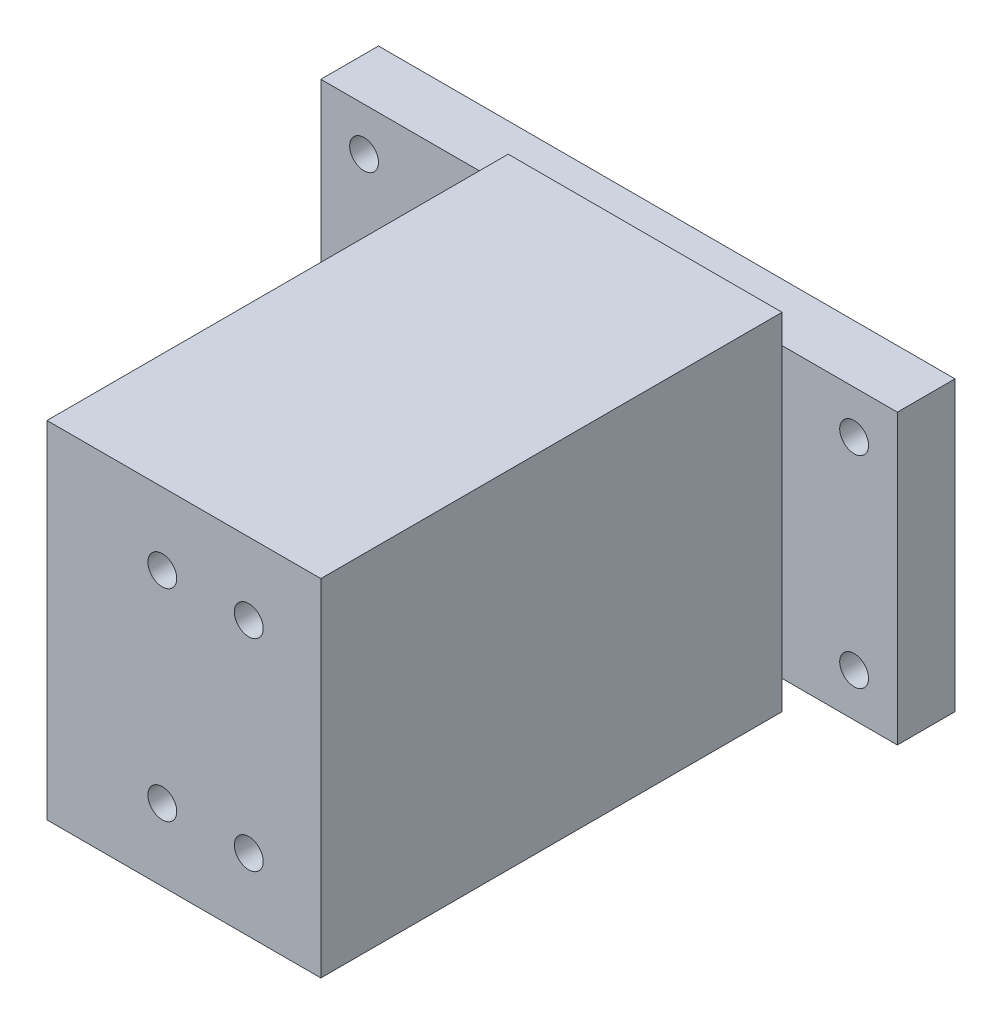
ISO-10303-21;
HEADER;
FILE_DESCRIPTION(('STEP AP214'),'2;1');
FILE_NAME('part.step','',(''),(''),'','','');
FILE_SCHEMA(('AUTOMOTIVE_DESIGN { 1 0 10303 214 1 1 1 1 }'));
ENDSEC;
DATA;
#1=APPLICATION_CONTEXT('core data for automotive mechanical design processes');
#2=APPLICATION_PROTOCOL_DEFINITION('international standard','automotive_design',2000,#1);
#3=PRODUCT_CONTEXT('',#1,'mechanical');
#4=PRODUCT('Part','Part','',(#3));
#5=PRODUCT_RELATED_PRODUCT_CATEGORY('part','',(#4));
#6=PRODUCT_DEFINITION_FORMATION('','',#4);
#7=PRODUCT_DEFINITION_CONTEXT('part definition',#1,'design');
#8=PRODUCT_DEFINITION('design','',#6,#7);
#9=PRODUCT_DEFINITION_SHAPE('','',#8);
#10=(LENGTH_UNIT() NAMED_UNIT(*) SI_UNIT(.MILLI.,.METRE.));
#11=(NAMED_UNIT(*) PLANE_ANGLE_UNIT() SI_UNIT($,.RADIAN.));
#12=(NAMED_UNIT(*) SI_UNIT($,.STERADIAN.) SOLID_ANGLE_UNIT());
#13=UNCERTAINTY_MEASURE_WITH_UNIT(LENGTH_MEASURE(1.E-05),#10,'distance_accuracy_value','');
#14=(GEOMETRIC_REPRESENTATION_CONTEXT(3) GLOBAL_UNCERTAINTY_ASSIGNED_CONTEXT((#13)) GLOBAL_UNIT_ASSIGNED_CONTEXT((#10,
#11,#12)) REPRESENTATION_CONTEXT('',''));
#15=CARTESIAN_POINT('',(0.,0.,0.));
#16=DIRECTION('',(0.,0.,1.));
#17=DIRECTION('',(1.,0.,0.));
#18=AXIS2_PLACEMENT_3D('',#15,#16,#17);
#19=CARTESIAN_POINT('',(0.,0.,10.));
#20=DIRECTION('',(0.,0.,1.));
#21=DIRECTION('',(1.,0.,0.));
#22=AXIS2_PLACEMENT_3D('',#19,#20,#21);
#23=PLANE('',#22);
#24=DIRECTION('',(0.,1.,0.));
#25=VECTOR('',#24,1.);
#26=CARTESIAN_POINT('',(30.,30.,10.));
#27=LINE('',#26,#25);
#28=CARTESIAN_POINT('',(30.,-25.,10.));
#29=VERTEX_POINT('',#28);
#30=CARTESIAN_POINT('',(30.,25.,10.));
#31=VERTEX_POINT('',#30);
#32=EDGE_CURVE('E11',#29,#31,#27,.T.);
#33=ORIENTED_EDGE('',*,*,#32,.F.);
#34=DIRECTION('',(1.,0.,0.));
#35=VECTOR('',#34,1.);
#36=CARTESIAN_POINT('',(-50.,-25.,10.));
#37=LINE('',#36,#35);
#38=CARTESIAN_POINT('',(50.,-25.,10.));
#39=VERTEX_POINT('',#38);
#40=EDGE_CURVE('E202',#29,#39,#37,.T.);
#41=ORIENTED_EDGE('',*,*,#40,.T.);
#42=DIRECTION('',(0.,1.,0.));
#43=VECTOR('',#42,1.);
#44=CARTESIAN_POINT('',(50.,25.,10.));
#45=LINE('',#44,#43);
#46=CARTESIAN_POINT('',(50.,25.,10.));
#47=VERTEX_POINT('',#46);
#48=EDGE_CURVE('E189',#39,#47,#45,.T.);
#49=ORIENTED_EDGE('',*,*,#48,.T.);
#50=DIRECTION('',(-1.,0.,0.));
#51=VECTOR('',#50,1.);
#52=CARTESIAN_POINT('',(-50.,25.,10.));
#53=LINE('',#52,#51);
#54=EDGE_CURVE('E195',#47,#31,#53,.T.);
#55=ORIENTED_EDGE('',*,*,#54,.T.);
#56=EDGE_LOOP('',(#33,#41,#49,#55));
#57=FACE_BOUND('',#56,.T.);
#58=CARTESIAN_POINT('',(42.5,17.5,10.));
#59=DIRECTION('',(0.,0.,1.));
#60=DIRECTION('',(1.,0.,0.));
#61=AXIS2_PLACEMENT_3D('',#58,#59,#60);
#62=CIRCLE('',#61,2.5);
#63=CARTESIAN_POINT('',(45.,17.5,10.));
#64=VERTEX_POINT('',#63);
#65=EDGE_CURVE('E173',#64,#64,#62,.T.);
#66=ORIENTED_EDGE('',*,*,#65,.F.);
#67=EDGE_LOOP('',(#66));
#68=FACE_BOUND('',#67,.T.);
#69=CARTESIAN_POINT('',(42.5,-17.5,10.));
#70=DIRECTION('',(0.,0.,1.));
#71=DIRECTION('',(1.,0.,0.));
#72=AXIS2_PLACEMENT_3D('',#69,#70,#71);
#73=CIRCLE('',#72,2.5);
#74=CARTESIAN_POINT('',(45.,-17.5,10.));
#75=VERTEX_POINT('',#74);
#76=EDGE_CURVE('E165',#75,#75,#73,.T.);
#77=ORIENTED_EDGE('',*,*,#76,.F.);
#78=EDGE_LOOP('',(#77));
#79=FACE_BOUND('',#78,.T.);
#80=ADVANCED_FACE('F42',(#57,#68,#79),#23,.T.);
#81=DIRECTION('',(0.,-1.,0.));
#82=VECTOR('',#81,1.);
#83=CARTESIAN_POINT('',(-17.5,30.,10.));
#84=LINE('',#83,#82);
#85=CARTESIAN_POINT('',(-17.5,25.,10.));
#86=VERTEX_POINT('',#85);
#87=CARTESIAN_POINT('',(-17.5,-25.,10.));
#88=VERTEX_POINT('',#87);
#89=EDGE_CURVE('E52',#86,#88,#84,.T.);
#90=ORIENTED_EDGE('',*,*,#89,.F.);
#91=CARTESIAN_POINT('',(-50.,25.,10.));
#92=VERTEX_POINT('',#91);
#93=EDGE_CURVE('E193',#86,#92,#53,.T.);
#94=ORIENTED_EDGE('',*,*,#93,.T.);
#95=DIRECTION('',(0.,-1.,0.));
#96=VECTOR('',#95,1.);
#97=CARTESIAN_POINT('',(-50.,25.,10.));
#98=LINE('',#97,#96);
#99=CARTESIAN_POINT('',(-50.,-25.,10.));
#100=VERTEX_POINT('',#99);
#101=EDGE_CURVE('E198',#92,#100,#98,.T.);
#102=ORIENTED_EDGE('',*,*,#101,.T.);
#103=EDGE_CURVE('E203',#100,#88,#37,.T.);
#104=ORIENTED_EDGE('',*,*,#103,.T.);
#105=EDGE_LOOP('',(#90,#94,#102,#104));
#106=FACE_BOUND('',#105,.T.);
#107=CARTESIAN_POINT('',(-42.5,17.5,10.));
#108=DIRECTION('',(0.,0.,1.));
#109=DIRECTION('',(1.,0.,0.));
#110=AXIS2_PLACEMENT_3D('',#107,#108,#109);
#111=CIRCLE('',#110,2.5);
#112=CARTESIAN_POINT('',(-40.,17.5,10.));
#113=VERTEX_POINT('',#112);
#114=EDGE_CURVE('E181',#113,#113,#111,.T.);
#115=ORIENTED_EDGE('',*,*,#114,.F.);
#116=EDGE_LOOP('',(#115));
#117=FACE_BOUND('',#116,.T.);
#118=CARTESIAN_POINT('',(-42.5,-17.5,10.));
#119=DIRECTION('',(0.,0.,1.));
#120=DIRECTION('',(1.,0.,0.));
#121=AXIS2_PLACEMENT_3D('',#118,#119,#120);
#122=CIRCLE('',#121,2.5);
#123=CARTESIAN_POINT('',(-40.,-17.5,10.));
#124=VERTEX_POINT('',#123);
#125=EDGE_CURVE('E155',#124,#124,#122,.T.);
#126=ORIENTED_EDGE('',*,*,#125,.F.);
#127=EDGE_LOOP('',(#126));
#128=FACE_BOUND('',#127,.T.);
#129=ADVANCED_FACE('F338',(#106,#117,#128),#23,.T.);
#130=CARTESIAN_POINT('',(0.,0.,0.));
#131=DIRECTION('',(0.,0.,1.));
#132=DIRECTION('',(1.,0.,0.));
#133=AXIS2_PLACEMENT_3D('',#130,#131,#132);
#134=PLANE('',#133);
#135=DIRECTION('',(0.,1.,0.));
#136=VECTOR('',#135,1.);
#137=CARTESIAN_POINT('',(50.,25.,0.));
#138=LINE('',#137,#136);
#139=CARTESIAN_POINT('',(50.,-25.,0.));
#140=VERTEX_POINT('',#139);
#141=CARTESIAN_POINT('',(50.,25.,0.));
#142=VERTEX_POINT('',#141);
#143=EDGE_CURVE('E185',#140,#142,#138,.T.);
#144=ORIENTED_EDGE('',*,*,#143,.F.);
#145=DIRECTION('',(1.,0.,0.));
#146=VECTOR('',#145,1.);
#147=CARTESIAN_POINT('',(-50.,-25.,0.));
#148=LINE('',#147,#146);
#149=CARTESIAN_POINT('',(-50.,-25.,0.));
#150=VERTEX_POINT('',#149);
#151=EDGE_CURVE('E194',#150,#140,#148,.T.);
#152=ORIENTED_EDGE('',*,*,#151,.F.);
#153=DIRECTION('',(0.,-1.,0.));
#154=VECTOR('',#153,1.);
#155=CARTESIAN_POINT('',(-50.,25.,0.));
#156=LINE('',#155,#154);
#157=CARTESIAN_POINT('',(-50.,25.,0.));
#158=VERTEX_POINT('',#157);
#159=EDGE_CURVE('E214',#158,#150,#156,.T.);
#160=ORIENTED_EDGE('',*,*,#159,.F.);
#161=DIRECTION('',(-1.,0.,0.));
#162=VECTOR('',#161,1.);
#163=CARTESIAN_POINT('',(-50.,25.,0.));
#164=LINE('',#163,#162);
#165=EDGE_CURVE('E211',#142,#158,#164,.T.);
#166=ORIENTED_EDGE('',*,*,#165,.F.);
#167=EDGE_LOOP('',(#144,#152,#160,#166));
#168=FACE_BOUND('',#167,.T.);
#169=CARTESIAN_POINT('',(-42.5,17.5,0.));
#170=DIRECTION('',(0.,0.,1.));
#171=DIRECTION('',(1.,0.,0.));
#172=AXIS2_PLACEMENT_3D('',#169,#170,#171);
#173=CIRCLE('',#172,2.5);
#174=CARTESIAN_POINT('',(-40.,17.5,0.));
#175=VERTEX_POINT('',#174);
#176=EDGE_CURVE('E177',#175,#175,#173,.T.);
#177=ORIENTED_EDGE('',*,*,#176,.T.);
#178=EDGE_LOOP('',(#177));
#179=FACE_BOUND('',#178,.T.);
#180=CARTESIAN_POINT('',(42.5,17.5,0.));
#181=DIRECTION('',(0.,0.,1.));
#182=DIRECTION('',(1.,0.,0.));
#183=AXIS2_PLACEMENT_3D('',#180,#181,#182);
#184=CIRCLE('',#183,2.5);
#185=CARTESIAN_POINT('',(45.,17.5,0.));
#186=VERTEX_POINT('',#185);
#187=EDGE_CURVE('E169',#186,#186,#184,.T.);
#188=ORIENTED_EDGE('',*,*,#187,.T.);
#189=EDGE_LOOP('',(#188));
#190=FACE_BOUND('',#189,.T.);
#191=CARTESIAN_POINT('',(42.5,-17.5,0.));
#192=DIRECTION('',(0.,0.,1.));
#193=DIRECTION('',(1.,0.,0.));
#194=AXIS2_PLACEMENT_3D('',#191,#192,#193);
#195=CIRCLE('',#194,2.5);
#196=CARTESIAN_POINT('',(45.,-17.5,0.));
#197=VERTEX_POINT('',#196);
#198=EDGE_CURVE('E163',#197,#197,#195,.T.);
#199=ORIENTED_EDGE('',*,*,#198,.T.);
#200=EDGE_LOOP('',(#199));
#201=FACE_BOUND('',#200,.T.);
#202=CARTESIAN_POINT('',(-42.5,-17.5,0.));
#203=DIRECTION('',(0.,0.,1.));
#204=DIRECTION('',(1.,0.,0.));
#205=AXIS2_PLACEMENT_3D('',#202,#203,#204);
#206=CIRCLE('',#205,2.5);
#207=CARTESIAN_POINT('',(-40.,-17.5,0.));
#208=VERTEX_POINT('',#207);
#209=EDGE_CURVE('E150',#208,#208,#206,.T.);
#210=ORIENTED_EDGE('',*,*,#209,.T.);
#211=EDGE_LOOP('',(#210));
#212=FACE_BOUND('',#211,.T.);
#213=ADVANCED_FACE('F374',(#168,#179,#190,#201,#212),#134,.F.);
#214=CARTESIAN_POINT('',(50.,25.,10.));
#215=DIRECTION('',(-1.,0.,0.));
#216=DIRECTION('',(0.,-1.,0.));
#217=AXIS2_PLACEMENT_3D('',#214,#215,#216);
#218=PLANE('',#217);
#219=ORIENTED_EDGE('',*,*,#143,.T.);
#220=DIRECTION('',(0.,0.,-1.));
#221=VECTOR('',#220,1.);
#222=CARTESIAN_POINT('',(50.,25.,10.));
#223=LINE('',#222,#221);
#224=EDGE_CURVE('E46',#47,#142,#223,.T.);
#225=ORIENTED_EDGE('',*,*,#224,.F.);
#226=ORIENTED_EDGE('',*,*,#48,.F.);
#227=DIRECTION('',(0.,0.,-1.));
#228=VECTOR('',#227,1.);
#229=CARTESIAN_POINT('',(50.,-25.,10.));
#230=LINE('',#229,#228);
#231=EDGE_CURVE('E206',#39,#140,#230,.T.);
#232=ORIENTED_EDGE('',*,*,#231,.T.);
#233=EDGE_LOOP('',(#219,#225,#226,#232));
#234=FACE_BOUND('',#233,.T.);
#235=ADVANCED_FACE('F44',(#234),#218,.F.);
#236=CARTESIAN_POINT('',(-50.,25.,10.));
#237=DIRECTION('',(0.,-1.,0.));
#238=DIRECTION('',(0.,0.,-1.));
#239=AXIS2_PLACEMENT_3D('',#236,#237,#238);
#240=PLANE('',#239);
#241=ORIENTED_EDGE('',*,*,#165,.T.);
#242=DIRECTION('',(0.,0.,-1.));
#243=VECTOR('',#242,1.);
#244=CARTESIAN_POINT('',(-50.,25.,10.));
#245=LINE('',#244,#243);
#246=EDGE_CURVE('E225',#92,#158,#245,.T.);
#247=ORIENTED_EDGE('',*,*,#246,.F.);
#248=ORIENTED_EDGE('',*,*,#93,.F.);
#249=EDGE_CURVE('E199',#31,#86,#53,.T.);
#250=ORIENTED_EDGE('',*,*,#249,.F.);
#251=ORIENTED_EDGE('',*,*,#54,.F.);
#252=ORIENTED_EDGE('',*,*,#224,.T.);
#253=EDGE_LOOP('',(#241,#247,#248,#250,#251,#252));
#254=FACE_BOUND('',#253,.T.);
#255=ADVANCED_FACE('F341',(#254),#240,.F.);
#256=CARTESIAN_POINT('',(-50.,25.,10.));
#257=DIRECTION('',(1.,0.,0.));
#258=DIRECTION('',(0.,0.,-1.));
#259=AXIS2_PLACEMENT_3D('',#256,#257,#258);
#260=PLANE('',#259);
#261=ORIENTED_EDGE('',*,*,#159,.T.);
#262=DIRECTION('',(0.,0.,-1.));
#263=VECTOR('',#262,1.);
#264=CARTESIAN_POINT('',(-50.,-25.,10.));
#265=LINE('',#264,#263);
#266=EDGE_CURVE('E222',#100,#150,#265,.T.);
#267=ORIENTED_EDGE('',*,*,#266,.F.);
#268=ORIENTED_EDGE('',*,*,#101,.F.);
#269=ORIENTED_EDGE('',*,*,#246,.T.);
#270=EDGE_LOOP('',(#261,#267,#268,#269));
#271=FACE_BOUND('',#270,.T.);
#272=ADVANCED_FACE('F342',(#271),#260,.F.);
#273=CARTESIAN_POINT('',(-50.,-25.,10.));
#274=DIRECTION('',(0.,1.,0.));
#275=DIRECTION('',(0.,0.,1.));
#276=AXIS2_PLACEMENT_3D('',#273,#274,#275);
#277=PLANE('',#276);
#278=ORIENTED_EDGE('',*,*,#151,.T.);
#279=ORIENTED_EDGE('',*,*,#231,.F.);
#280=ORIENTED_EDGE('',*,*,#40,.F.);
#281=EDGE_CURVE('E207',#88,#29,#37,.T.);
#282=ORIENTED_EDGE('',*,*,#281,.F.);
#283=ORIENTED_EDGE('',*,*,#103,.F.);
#284=ORIENTED_EDGE('',*,*,#266,.T.);
#285=EDGE_LOOP('',(#278,#279,#280,#282,#283,#284));
#286=FACE_BOUND('',#285,.T.);
#287=ADVANCED_FACE('F347',(#286),#277,.F.);
#288=CARTESIAN_POINT('',(-42.5,17.5,10.));
#289=DIRECTION('',(0.,0.,-1.));
#290=DIRECTION('',(-1.,0.,0.));
#291=AXIS2_PLACEMENT_3D('',#288,#289,#290);
#292=CYLINDRICAL_SURFACE('',#291,2.5);
#293=ORIENTED_EDGE('',*,*,#114,.T.);
#294=EDGE_LOOP('',(#293));
#295=FACE_BOUND('',#294,.T.);
#296=ORIENTED_EDGE('',*,*,#176,.F.);
#297=EDGE_LOOP('',(#296));
#298=FACE_BOUND('',#297,.T.);
#299=ADVANCED_FACE('F378',(#295,#298),#292,.F.);
#300=CARTESIAN_POINT('',(42.5,17.5,10.));
#301=DIRECTION('',(0.,0.,-1.));
#302=DIRECTION('',(-1.,0.,0.));
#303=AXIS2_PLACEMENT_3D('',#300,#301,#302);
#304=CYLINDRICAL_SURFACE('',#303,2.5);
#305=ORIENTED_EDGE('',*,*,#65,.T.);
#306=EDGE_LOOP('',(#305));
#307=FACE_BOUND('',#306,.T.);
#308=ORIENTED_EDGE('',*,*,#187,.F.);
#309=EDGE_LOOP('',(#308));
#310=FACE_BOUND('',#309,.T.);
#311=ADVANCED_FACE('F414',(#307,#310),#304,.F.);
#312=CARTESIAN_POINT('',(42.5,-17.5,10.));
#313=DIRECTION('',(0.,0.,-1.));
#314=DIRECTION('',(-1.,0.,0.));
#315=AXIS2_PLACEMENT_3D('',#312,#313,#314);
#316=CYLINDRICAL_SURFACE('',#315,2.5);
#317=ORIENTED_EDGE('',*,*,#76,.T.);
#318=EDGE_LOOP('',(#317));
#319=FACE_BOUND('',#318,.T.);
#320=ORIENTED_EDGE('',*,*,#198,.F.);
#321=EDGE_LOOP('',(#320));
#322=FACE_BOUND('',#321,.T.);
#323=ADVANCED_FACE('F407',(#319,#322),#316,.F.);
#324=CARTESIAN_POINT('',(-42.5,-17.5,10.));
#325=DIRECTION('',(0.,0.,-1.));
#326=DIRECTION('',(-1.,0.,0.));
#327=AXIS2_PLACEMENT_3D('',#324,#325,#326);
#328=CYLINDRICAL_SURFACE('',#327,2.5);
#329=ORIENTED_EDGE('',*,*,#125,.T.);
#330=EDGE_LOOP('',(#329));
#331=FACE_BOUND('',#330,.T.);
#332=ORIENTED_EDGE('',*,*,#209,.F.);
#333=EDGE_LOOP('',(#332));
#334=FACE_BOUND('',#333,.T.);
#335=ADVANCED_FACE('F405',(#331,#334),#328,.F.);
#336=CARTESIAN_POINT('',(0.,0.,10.));
#337=DIRECTION('',(0.,0.,1.));
#338=DIRECTION('',(1.,0.,0.));
#339=AXIS2_PLACEMENT_3D('',#336,#337,#338);
#340=PLANE('',#339);
#341=CARTESIAN_POINT('',(30.,30.,10.));
#342=VERTEX_POINT('',#341);
#343=EDGE_CURVE('E55',#31,#342,#27,.T.);
#344=ORIENTED_EDGE('',*,*,#343,.F.);
#345=ORIENTED_EDGE('',*,*,#249,.T.);
#346=CARTESIAN_POINT('',(-17.5,30.,10.));
#347=VERTEX_POINT('',#346);
#348=EDGE_CURVE('E238',#347,#86,#84,.T.);
#349=ORIENTED_EDGE('',*,*,#348,.F.);
#350=DIRECTION('',(-1.,0.,0.));
#351=VECTOR('',#350,1.);
#352=CARTESIAN_POINT('',(-17.5,30.,10.));
#353=LINE('',#352,#351);
#354=EDGE_CURVE('E246',#342,#347,#353,.T.);
#355=ORIENTED_EDGE('',*,*,#354,.F.);
#356=EDGE_LOOP('',(#344,#345,#349,#355));
#357=FACE_BOUND('',#356,.T.);
#358=ADVANCED_FACE('F335',(#357),#340,.F.);
#359=CARTESIAN_POINT('',(-17.5,-30.,10.));
#360=VERTEX_POINT('',#359);
#361=EDGE_CURVE('E239',#88,#360,#84,.T.);
#362=ORIENTED_EDGE('',*,*,#361,.F.);
#363=ORIENTED_EDGE('',*,*,#281,.T.);
#364=CARTESIAN_POINT('',(30.,-30.,10.));
#365=VERTEX_POINT('',#364);
#366=EDGE_CURVE('E54',#365,#29,#27,.T.);
#367=ORIENTED_EDGE('',*,*,#366,.F.);
#368=DIRECTION('',(1.,0.,0.));
#369=VECTOR('',#368,1.);
#370=CARTESIAN_POINT('',(-17.5,-30.,10.));
#371=LINE('',#370,#369);
#372=EDGE_CURVE('E143',#360,#365,#371,.T.);
#373=ORIENTED_EDGE('',*,*,#372,.F.);
#374=EDGE_LOOP('',(#362,#363,#367,#373));
#375=FACE_BOUND('',#374,.T.);
#376=ADVANCED_FACE('F354',(#375),#340,.F.);
#377=CARTESIAN_POINT('',(30.,30.,90.));
#378=DIRECTION('',(-1.,0.,0.));
#379=DIRECTION('',(0.,-1.,0.));
#380=AXIS2_PLACEMENT_3D('',#377,#378,#379);
#381=PLANE('',#380);
#382=ORIENTED_EDGE('',*,*,#366,.T.);
#383=ORIENTED_EDGE('',*,*,#32,.T.);
#384=ORIENTED_EDGE('',*,*,#343,.T.);
#385=DIRECTION('',(0.,0.,-1.));
#386=VECTOR('',#385,1.);
#387=CARTESIAN_POINT('',(30.,30.,90.));
#388=LINE('',#387,#386);
#389=CARTESIAN_POINT('',(30.,30.,90.));
#390=VERTEX_POINT('',#389);
#391=EDGE_CURVE('E126',#390,#342,#388,.T.);
#392=ORIENTED_EDGE('',*,*,#391,.F.);
#393=DIRECTION('',(0.,1.,0.));
#394=VECTOR('',#393,1.);
#395=CARTESIAN_POINT('',(30.,30.,90.));
#396=LINE('',#395,#394);
#397=CARTESIAN_POINT('',(30.,-30.,90.));
#398=VERTEX_POINT('',#397);
#399=EDGE_CURVE('E133',#398,#390,#396,.T.);
#400=ORIENTED_EDGE('',*,*,#399,.F.);
#401=DIRECTION('',(0.,0.,-1.));
#402=VECTOR('',#401,1.);
#403=CARTESIAN_POINT('',(30.,-30.,90.));
#404=LINE('',#403,#402);
#405=EDGE_CURVE('E255',#398,#365,#404,.T.);
#406=ORIENTED_EDGE('',*,*,#405,.T.);
#407=EDGE_LOOP('',(#382,#383,#384,#392,#400,#406));
#408=FACE_BOUND('',#407,.T.);
#409=ADVANCED_FACE('F146',(#408),#381,.F.);
#410=CARTESIAN_POINT('',(-17.5,30.,90.));
#411=DIRECTION('',(0.,-1.,0.));
#412=DIRECTION('',(0.,0.,-1.));
#413=AXIS2_PLACEMENT_3D('',#410,#411,#412);
#414=PLANE('',#413);
#415=ORIENTED_EDGE('',*,*,#354,.T.);
#416=DIRECTION('',(0.,0.,-1.));
#417=VECTOR('',#416,1.);
#418=CARTESIAN_POINT('',(-17.5,30.,90.));
#419=LINE('',#418,#417);
#420=CARTESIAN_POINT('',(-17.5,30.,90.));
#421=VERTEX_POINT('',#420);
#422=EDGE_CURVE('E128',#421,#347,#419,.T.);
#423=ORIENTED_EDGE('',*,*,#422,.F.);
#424=DIRECTION('',(-1.,0.,0.));
#425=VECTOR('',#424,1.);
#426=CARTESIAN_POINT('',(-17.5,30.,90.));
#427=LINE('',#426,#425);
#428=EDGE_CURVE('E122',#390,#421,#427,.T.);
#429=ORIENTED_EDGE('',*,*,#428,.F.);
#430=ORIENTED_EDGE('',*,*,#391,.T.);
#431=EDGE_LOOP('',(#415,#423,#429,#430));
#432=FACE_BOUND('',#431,.T.);
#433=ADVANCED_FACE('F124',(#432),#414,.F.);
#434=CARTESIAN_POINT('',(-17.5,30.,90.));
#435=DIRECTION('',(1.,0.,0.));
#436=DIRECTION('',(0.,1.,0.));
#437=AXIS2_PLACEMENT_3D('',#434,#435,#436);
#438=PLANE('',#437);
#439=CARTESIAN_POINT('',(-17.5,15.,42.5));
#440=DIRECTION('',(-1.,0.,0.));
#441=DIRECTION('',(0.,-1.,0.));
#442=AXIS2_PLACEMENT_3D('',#439,#440,#441);
#443=CIRCLE('',#442,2.5);
#444=CARTESIAN_POINT('',(-17.5,12.5,42.5));
#445=VERTEX_POINT('',#444);
#446=EDGE_CURVE('E303',#445,#445,#443,.T.);
#447=ORIENTED_EDGE('',*,*,#446,.F.);
#448=EDGE_LOOP('',(#447));
#449=FACE_BOUND('',#448,.T.);
#450=CARTESIAN_POINT('',(-17.5,-20.,77.5));
#451=DIRECTION('',(-1.,0.,0.));
#452=DIRECTION('',(0.,-1.,0.));
#453=AXIS2_PLACEMENT_3D('',#450,#451,#452);
#454=CIRCLE('',#453,2.49999999999999);
#455=CARTESIAN_POINT('',(-17.5,-22.5,77.5));
#456=VERTEX_POINT('',#455);
#457=EDGE_CURVE('E311',#456,#456,#454,.T.);
#458=ORIENTED_EDGE('',*,*,#457,.F.);
#459=EDGE_LOOP('',(#458));
#460=FACE_BOUND('',#459,.T.);
#461=CARTESIAN_POINT('',(-17.5,-20.,42.5));
#462=DIRECTION('',(-1.,0.,0.));
#463=DIRECTION('',(0.,-1.,0.));
#464=AXIS2_PLACEMENT_3D('',#461,#462,#463);
#465=CIRCLE('',#464,2.5);
#466=CARTESIAN_POINT('',(-17.5,-22.5,42.5));
#467=VERTEX_POINT('',#466);
#468=EDGE_CURVE('E295',#467,#467,#465,.T.);
#469=ORIENTED_EDGE('',*,*,#468,.F.);
#470=EDGE_LOOP('',(#469));
#471=FACE_BOUND('',#470,.T.);
#472=CARTESIAN_POINT('',(-17.5,15.,77.5));
#473=DIRECTION('',(-1.,0.,0.));
#474=DIRECTION('',(0.,-1.,0.));
#475=AXIS2_PLACEMENT_3D('',#472,#473,#474);
#476=CIRCLE('',#475,2.50000000000001);
#477=CARTESIAN_POINT('',(-17.5,12.5,77.5));
#478=VERTEX_POINT('',#477);
#479=EDGE_CURVE('E291',#478,#478,#476,.T.);
#480=ORIENTED_EDGE('',*,*,#479,.F.);
#481=EDGE_LOOP('',(#480));
#482=FACE_BOUND('',#481,.T.);
#483=ORIENTED_EDGE('',*,*,#348,.T.);
#484=ORIENTED_EDGE('',*,*,#89,.T.);
#485=ORIENTED_EDGE('',*,*,#361,.T.);
#486=DIRECTION('',(0.,0.,-1.));
#487=VECTOR('',#486,1.);
#488=CARTESIAN_POINT('',(-17.5,-30.,90.));
#489=LINE('',#488,#487);
#490=CARTESIAN_POINT('',(-17.5,-30.,90.));
#491=VERTEX_POINT('',#490);
#492=EDGE_CURVE('E157',#491,#360,#489,.T.);
#493=ORIENTED_EDGE('',*,*,#492,.F.);
#494=DIRECTION('',(0.,-1.,0.));
#495=VECTOR('',#494,1.);
#496=CARTESIAN_POINT('',(-17.5,30.,90.));
#497=LINE('',#496,#495);
#498=EDGE_CURVE('E132',#421,#491,#497,.T.);
#499=ORIENTED_EDGE('',*,*,#498,.F.);
#500=ORIENTED_EDGE('',*,*,#422,.T.);
#501=EDGE_LOOP('',(#483,#484,#485,#493,#499,#500));
#502=FACE_BOUND('',#501,.T.);
#503=ADVANCED_FACE('F325',(#449,#460,#471,#482,#502),#438,.F.);
#504=CARTESIAN_POINT('',(-17.5,-30.,90.));
#505=DIRECTION('',(0.,1.,0.));
#506=DIRECTION('',(0.,0.,1.));
#507=AXIS2_PLACEMENT_3D('',#504,#505,#506);
#508=PLANE('',#507);
#509=ORIENTED_EDGE('',*,*,#372,.T.);
#510=ORIENTED_EDGE('',*,*,#405,.F.);
#511=DIRECTION('',(1.,0.,0.));
#512=VECTOR('',#511,1.);
#513=CARTESIAN_POINT('',(-17.5,-30.,90.));
#514=LINE('',#513,#512);
#515=EDGE_CURVE('E138',#491,#398,#514,.T.);
#516=ORIENTED_EDGE('',*,*,#515,.F.);
#517=ORIENTED_EDGE('',*,*,#492,.T.);
#518=EDGE_LOOP('',(#509,#510,#516,#517));
#519=FACE_BOUND('',#518,.T.);
#520=ADVANCED_FACE('F328',(#519),#508,.F.);
#521=CARTESIAN_POINT('',(0.,0.,90.));
#522=DIRECTION('',(0.,0.,1.));
#523=DIRECTION('',(1.,0.,0.));
#524=AXIS2_PLACEMENT_3D('',#521,#522,#523);
#525=PLANE('',#524);
#526=CARTESIAN_POINT('',(17.5,-17.5,90.));
#527=DIRECTION('',(0.,0.,1.));
#528=DIRECTION('',(1.,0.,0.));
#529=AXIS2_PLACEMENT_3D('',#526,#527,#528);
#530=CIRCLE('',#529,2.5);
#531=CARTESIAN_POINT('',(20.,-17.5,90.));
#532=VERTEX_POINT('',#531);
#533=EDGE_CURVE('E271',#532,#532,#530,.T.);
#534=ORIENTED_EDGE('',*,*,#533,.F.);
#535=EDGE_LOOP('',(#534));
#536=FACE_BOUND('',#535,.T.);
#537=CARTESIAN_POINT('',(2.50000000000001,-17.5,90.));
#538=DIRECTION('',(0.,0.,1.));
#539=DIRECTION('',(1.,0.,0.));
#540=AXIS2_PLACEMENT_3D('',#537,#538,#539);
#541=CIRCLE('',#540,2.5);
#542=CARTESIAN_POINT('',(5.00000000000001,-17.5,90.));
#543=VERTEX_POINT('',#542);
#544=EDGE_CURVE('E280',#543,#543,#541,.T.);
#545=ORIENTED_EDGE('',*,*,#544,.F.);
#546=EDGE_LOOP('',(#545));
#547=FACE_BOUND('',#546,.T.);
#548=CARTESIAN_POINT('',(2.50000000000001,17.5,90.));
#549=DIRECTION('',(0.,0.,1.));
#550=DIRECTION('',(1.,0.,0.));
#551=AXIS2_PLACEMENT_3D('',#548,#549,#550);
#552=CIRCLE('',#551,2.5);
#553=CARTESIAN_POINT('',(5.00000000000001,17.5,90.));
#554=VERTEX_POINT('',#553);
#555=EDGE_CURVE('E263',#554,#554,#552,.T.);
#556=ORIENTED_EDGE('',*,*,#555,.F.);
#557=EDGE_LOOP('',(#556));
#558=FACE_BOUND('',#557,.T.);
#559=CARTESIAN_POINT('',(17.5,17.5,90.));
#560=DIRECTION('',(0.,0.,1.));
#561=DIRECTION('',(1.,0.,0.));
#562=AXIS2_PLACEMENT_3D('',#559,#560,#561);
#563=CIRCLE('',#562,2.5);
#564=CARTESIAN_POINT('',(20.,17.5,90.));
#565=VERTEX_POINT('',#564);
#566=EDGE_CURVE('E258',#565,#565,#563,.T.);
#567=ORIENTED_EDGE('',*,*,#566,.F.);
#568=EDGE_LOOP('',(#567));
#569=FACE_BOUND('',#568,.T.);
#570=ORIENTED_EDGE('',*,*,#399,.T.);
#571=ORIENTED_EDGE('',*,*,#428,.T.);
#572=ORIENTED_EDGE('',*,*,#498,.T.);
#573=ORIENTED_EDGE('',*,*,#515,.T.);
#574=EDGE_LOOP('',(#570,#571,#572,#573));
#575=FACE_BOUND('',#574,.T.);
#576=ADVANCED_FACE('F136',(#536,#547,#558,#569,#575),#525,.T.);
#577=CARTESIAN_POINT('',(17.5,17.5,80.));
#578=DIRECTION('',(0.,0.,1.));
#579=DIRECTION('',(1.,0.,0.));
#580=AXIS2_PLACEMENT_3D('',#577,#578,#579);
#581=CYLINDRICAL_SURFACE('',#580,2.5);
#582=CARTESIAN_POINT('',(17.5,17.5,80.));
#583=DIRECTION('',(0.,0.,1.));
#584=DIRECTION('',(1.,0.,0.));
#585=AXIS2_PLACEMENT_3D('',#582,#583,#584);
#586=CIRCLE('',#585,2.5);
#587=CARTESIAN_POINT('',(20.,17.5,80.));
#588=VERTEX_POINT('',#587);
#589=EDGE_CURVE('E262',#588,#588,#586,.T.);
#590=ORIENTED_EDGE('',*,*,#589,.F.);
#591=EDGE_LOOP('',(#590));
#592=FACE_BOUND('',#591,.T.);
#593=ORIENTED_EDGE('',*,*,#566,.T.);
#594=EDGE_LOOP('',(#593));
#595=FACE_BOUND('',#594,.T.);
#596=ADVANCED_FACE('F365',(#592,#595),#581,.F.);
#597=CARTESIAN_POINT('',(17.5,17.5,80.));
#598=DIRECTION('',(0.,0.,1.));
#599=DIRECTION('',(1.,0.,0.));
#600=AXIS2_PLACEMENT_3D('',#597,#598,#599);
#601=PLANE('',#600);
#602=ORIENTED_EDGE('',*,*,#589,.T.);
#603=EDGE_LOOP('',(#602));
#604=FACE_BOUND('',#603,.T.);
#605=ADVANCED_FACE('F555',(#604),#601,.T.);
#606=CARTESIAN_POINT('',(2.50000000000001,17.5,80.));
#607=DIRECTION('',(0.,0.,1.));
#608=DIRECTION('',(1.,0.,0.));
#609=AXIS2_PLACEMENT_3D('',#606,#607,#608);
#610=CYLINDRICAL_SURFACE('',#609,2.5);
#611=CARTESIAN_POINT('',(2.50000000000001,17.5,80.));
#612=DIRECTION('',(0.,0.,1.));
#613=DIRECTION('',(1.,0.,0.));
#614=AXIS2_PLACEMENT_3D('',#611,#612,#613);
#615=CIRCLE('',#614,2.5);
#616=CARTESIAN_POINT('',(5.00000000000001,17.5,80.));
#617=VERTEX_POINT('',#616);
#618=EDGE_CURVE('E284',#617,#617,#615,.T.);
#619=ORIENTED_EDGE('',*,*,#618,.F.);
#620=EDGE_LOOP('',(#619));
#621=FACE_BOUND('',#620,.T.);
#622=ORIENTED_EDGE('',*,*,#555,.T.);
#623=EDGE_LOOP('',(#622));
#624=FACE_BOUND('',#623,.T.);
#625=ADVANCED_FACE('F565',(#621,#624),#610,.F.);
#626=CARTESIAN_POINT('',(2.50000000000001,17.5,80.));
#627=DIRECTION('',(0.,0.,1.));
#628=DIRECTION('',(1.,0.,0.));
#629=AXIS2_PLACEMENT_3D('',#626,#627,#628);
#630=PLANE('',#629);
#631=ORIENTED_EDGE('',*,*,#618,.T.);
#632=EDGE_LOOP('',(#631));
#633=FACE_BOUND('',#632,.T.);
#634=ADVANCED_FACE('F575',(#633),#630,.T.);
#635=CARTESIAN_POINT('',(2.50000000000001,-17.5,80.));
#636=DIRECTION('',(0.,0.,1.));
#637=DIRECTION('',(1.,0.,0.));
#638=AXIS2_PLACEMENT_3D('',#635,#636,#637);
#639=CYLINDRICAL_SURFACE('',#638,2.5);
#640=CARTESIAN_POINT('',(2.50000000000001,-17.5,80.));
#641=DIRECTION('',(0.,0.,1.));
#642=DIRECTION('',(1.,0.,0.));
#643=AXIS2_PLACEMENT_3D('',#640,#641,#642);
#644=CIRCLE('',#643,2.5);
#645=CARTESIAN_POINT('',(5.00000000000001,-17.5,80.));
#646=VERTEX_POINT('',#645);
#647=EDGE_CURVE('E276',#646,#646,#644,.T.);
#648=ORIENTED_EDGE('',*,*,#647,.F.);
#649=EDGE_LOOP('',(#648));
#650=FACE_BOUND('',#649,.T.);
#651=ORIENTED_EDGE('',*,*,#544,.T.);
#652=EDGE_LOOP('',(#651));
#653=FACE_BOUND('',#652,.T.);
#654=ADVANCED_FACE('F585',(#650,#653),#639,.F.);
#655=CARTESIAN_POINT('',(2.50000000000001,-17.5,80.));
#656=DIRECTION('',(0.,0.,1.));
#657=DIRECTION('',(1.,0.,0.));
#658=AXIS2_PLACEMENT_3D('',#655,#656,#657);
#659=PLANE('',#658);
#660=ORIENTED_EDGE('',*,*,#647,.T.);
#661=EDGE_LOOP('',(#660));
#662=FACE_BOUND('',#661,.T.);
#663=ADVANCED_FACE('F595',(#662),#659,.T.);
#664=CARTESIAN_POINT('',(17.5,-17.5,80.));
#665=DIRECTION('',(0.,0.,1.));
#666=DIRECTION('',(1.,0.,0.));
#667=AXIS2_PLACEMENT_3D('',#664,#665,#666);
#668=CYLINDRICAL_SURFACE('',#667,2.5);
#669=CARTESIAN_POINT('',(17.5,-17.5,80.));
#670=DIRECTION('',(0.,0.,1.));
#671=DIRECTION('',(1.,0.,0.));
#672=AXIS2_PLACEMENT_3D('',#669,#670,#671);
#673=CIRCLE('',#672,2.5);
#674=CARTESIAN_POINT('',(20.,-17.5,80.));
#675=VERTEX_POINT('',#674);
#676=EDGE_CURVE('E267',#675,#675,#673,.T.);
#677=ORIENTED_EDGE('',*,*,#676,.F.);
#678=EDGE_LOOP('',(#677));
#679=FACE_BOUND('',#678,.T.);
#680=ORIENTED_EDGE('',*,*,#533,.T.);
#681=EDGE_LOOP('',(#680));
#682=FACE_BOUND('',#681,.T.);
#683=ADVANCED_FACE('F605',(#679,#682),#668,.F.);
#684=CARTESIAN_POINT('',(17.5,-17.5,80.));
#685=DIRECTION('',(0.,0.,1.));
#686=DIRECTION('',(1.,0.,0.));
#687=AXIS2_PLACEMENT_3D('',#684,#685,#686);
#688=PLANE('',#687);
#689=ORIENTED_EDGE('',*,*,#676,.T.);
#690=EDGE_LOOP('',(#689));
#691=FACE_BOUND('',#690,.T.);
#692=ADVANCED_FACE('F615',(#691),#688,.T.);
#693=CARTESIAN_POINT('',(-7.49999999999997,15.,77.5));
#694=DIRECTION('',(-1.,0.,0.));
#695=DIRECTION('',(0.,-1.,0.));
#696=AXIS2_PLACEMENT_3D('',#693,#694,#695);
#697=CYLINDRICAL_SURFACE('',#696,2.50000000000001);
#698=CARTESIAN_POINT('',(-7.49999999999997,15.,77.5));
#699=DIRECTION('',(-1.,0.,0.));
#700=DIRECTION('',(0.,-1.,0.));
#701=AXIS2_PLACEMENT_3D('',#698,#699,#700);
#702=CIRCLE('',#701,2.50000000000001);
#703=CARTESIAN_POINT('',(-7.49999999999997,12.5,77.5));
#704=VERTEX_POINT('',#703);
#705=EDGE_CURVE('E272',#704,#704,#702,.T.);
#706=ORIENTED_EDGE('',*,*,#705,.F.);
#707=EDGE_LOOP('',(#706));
#708=FACE_BOUND('',#707,.T.);
#709=ORIENTED_EDGE('',*,*,#479,.T.);
#710=EDGE_LOOP('',(#709));
#711=FACE_BOUND('',#710,.T.);
#712=ADVANCED_FACE('F625',(#708,#711),#697,.F.);
#713=CARTESIAN_POINT('',(-7.49999999999997,0.,0.));
#714=DIRECTION('',(-1.,0.,0.));
#715=DIRECTION('',(0.,-1.,0.));
#716=AXIS2_PLACEMENT_3D('',#713,#714,#715);
#717=PLANE('',#716);
#718=ORIENTED_EDGE('',*,*,#705,.T.);
#719=EDGE_LOOP('',(#718));
#720=FACE_BOUND('',#719,.T.);
#721=ADVANCED_FACE('F635',(#720),#717,.T.);
#722=CARTESIAN_POINT('',(-7.49999999999997,-20.,42.5));
#723=DIRECTION('',(-1.,0.,0.));
#724=DIRECTION('',(0.,-1.,0.));
#725=AXIS2_PLACEMENT_3D('',#722,#723,#724);
#726=CYLINDRICAL_SURFACE('',#725,2.5);
#727=CARTESIAN_POINT('',(-7.49999999999997,-20.,42.5));
#728=DIRECTION('',(-1.,0.,0.));
#729=DIRECTION('',(0.,-1.,0.));
#730=AXIS2_PLACEMENT_3D('',#727,#728,#729);
#731=CIRCLE('',#730,2.5);
#732=CARTESIAN_POINT('',(-7.49999999999997,-22.5,42.5));
#733=VERTEX_POINT('',#732);
#734=EDGE_CURVE('E315',#733,#733,#731,.T.);
#735=ORIENTED_EDGE('',*,*,#734,.F.);
#736=EDGE_LOOP('',(#735));
#737=FACE_BOUND('',#736,.T.);
#738=ORIENTED_EDGE('',*,*,#468,.T.);
#739=EDGE_LOOP('',(#738));
#740=FACE_BOUND('',#739,.T.);
#741=ADVANCED_FACE('F323',(#737,#740),#726,.F.);
#742=CARTESIAN_POINT('',(-7.49999999999997,0.,0.));
#743=DIRECTION('',(-1.,0.,0.));
#744=DIRECTION('',(0.,-1.,0.));
#745=AXIS2_PLACEMENT_3D('',#742,#743,#744);
#746=PLANE('',#745);
#747=ORIENTED_EDGE('',*,*,#734,.T.);
#748=EDGE_LOOP('',(#747));
#749=FACE_BOUND('',#748,.T.);
#750=ADVANCED_FACE('F654',(#749),#746,.T.);
#751=CARTESIAN_POINT('',(-7.49999999999997,-20.,77.5));
#752=DIRECTION('',(-1.,0.,0.));
#753=DIRECTION('',(0.,-1.,0.));
#754=AXIS2_PLACEMENT_3D('',#751,#752,#753);
#755=CYLINDRICAL_SURFACE('',#754,2.49999999999999);
#756=CARTESIAN_POINT('',(-7.49999999999997,-20.,77.5));
#757=DIRECTION('',(-1.,0.,0.));
#758=DIRECTION('',(0.,-1.,0.));
#759=AXIS2_PLACEMENT_3D('',#756,#757,#758);
#760=CIRCLE('',#759,2.49999999999999);
#761=CARTESIAN_POINT('',(-7.49999999999997,-22.5,77.5));
#762=VERTEX_POINT('',#761);
#763=EDGE_CURVE('E307',#762,#762,#760,.T.);
#764=ORIENTED_EDGE('',*,*,#763,.F.);
#765=EDGE_LOOP('',(#764));
#766=FACE_BOUND('',#765,.T.);
#767=ORIENTED_EDGE('',*,*,#457,.T.);
#768=EDGE_LOOP('',(#767));
#769=FACE_BOUND('',#768,.T.);
#770=ADVANCED_FACE('F664',(#766,#769),#755,.F.);
#771=CARTESIAN_POINT('',(-7.49999999999997,0.,0.));
#772=DIRECTION('',(-1.,0.,0.));
#773=DIRECTION('',(0.,-1.,0.));
#774=AXIS2_PLACEMENT_3D('',#771,#772,#773);
#775=PLANE('',#774);
#776=ORIENTED_EDGE('',*,*,#763,.T.);
#777=EDGE_LOOP('',(#776));
#778=FACE_BOUND('',#777,.T.);
#779=ADVANCED_FACE('F674',(#778),#775,.T.);
#780=CARTESIAN_POINT('',(-7.49999999999997,15.,42.5));
#781=DIRECTION('',(-1.,0.,0.));
#782=DIRECTION('',(0.,-1.,0.));
#783=AXIS2_PLACEMENT_3D('',#780,#781,#782);
#784=CYLINDRICAL_SURFACE('',#783,2.5);
#785=CARTESIAN_POINT('',(-7.49999999999997,15.,42.5));
#786=DIRECTION('',(-1.,0.,0.));
#787=DIRECTION('',(0.,-1.,0.));
#788=AXIS2_PLACEMENT_3D('',#785,#786,#787);
#789=CIRCLE('',#788,2.5);
#790=CARTESIAN_POINT('',(-7.49999999999997,12.5,42.5));
#791=VERTEX_POINT('',#790);
#792=EDGE_CURVE('E299',#791,#791,#789,.T.);
#793=ORIENTED_EDGE('',*,*,#792,.F.);
#794=EDGE_LOOP('',(#793));
#795=FACE_BOUND('',#794,.T.);
#796=ORIENTED_EDGE('',*,*,#446,.T.);
#797=EDGE_LOOP('',(#796));
#798=FACE_BOUND('',#797,.T.);
#799=ADVANCED_FACE('F684',(#795,#798),#784,.F.);
#800=CARTESIAN_POINT('',(-7.49999999999997,15.,42.5));
#801=DIRECTION('',(-1.,0.,0.));
#802=DIRECTION('',(0.,-1.,0.));
#803=AXIS2_PLACEMENT_3D('',#800,#801,#802);
#804=PLANE('',#803);
#805=ORIENTED_EDGE('',*,*,#792,.T.);
#806=EDGE_LOOP('',(#805));
#807=FACE_BOUND('',#806,.T.);
#808=ADVANCED_FACE('F694',(#807),#804,.T.);
#809=CLOSED_SHELL('',(#80,#129,#213,#235,#255,#272,#287,#299,#311,#323,#335,#358,#376,#409,#433,
#503,#520,#576,#596,#605,#625,#634,#654,#663,#683,#692,#712,#721,#741,#750,#770,#779,#799,#808));
#810=MANIFOLD_SOLID_BREP('B2',#809);
#811=ADVANCED_BREP_SHAPE_REPRESENTATION('',(#18,#810),#14);
#812=SHAPE_DEFINITION_REPRESENTATION(#9,#811);
ENDSEC;
END-ISO-10303-21;
